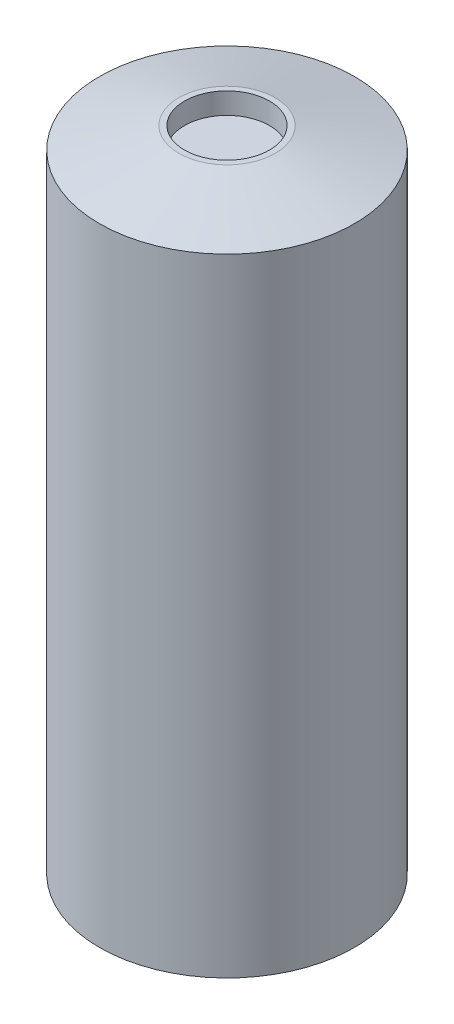
ISO-10303-21;
HEADER;
FILE_DESCRIPTION(('STEP AP214'),'2;1');
FILE_NAME('part.step','',(''),(''),'','','');
FILE_SCHEMA(('AUTOMOTIVE_DESIGN { 1 0 10303 214 1 1 1 1 }'));
ENDSEC;
DATA;
#1=APPLICATION_CONTEXT('core data for automotive mechanical design processes');
#2=APPLICATION_PROTOCOL_DEFINITION('international standard','automotive_design',2000,#1);
#3=PRODUCT_CONTEXT('',#1,'mechanical');
#4=PRODUCT('Part','Part','',(#3));
#5=PRODUCT_RELATED_PRODUCT_CATEGORY('part','',(#4));
#6=PRODUCT_DEFINITION_FORMATION('','',#4);
#7=PRODUCT_DEFINITION_CONTEXT('part definition',#1,'design');
#8=PRODUCT_DEFINITION('design','',#6,#7);
#9=PRODUCT_DEFINITION_SHAPE('','',#8);
#10=(LENGTH_UNIT() NAMED_UNIT(*) SI_UNIT(.MILLI.,.METRE.));
#11=(NAMED_UNIT(*) PLANE_ANGLE_UNIT() SI_UNIT($,.RADIAN.));
#12=(NAMED_UNIT(*) SI_UNIT($,.STERADIAN.) SOLID_ANGLE_UNIT());
#13=UNCERTAINTY_MEASURE_WITH_UNIT(LENGTH_MEASURE(1.E-05),#10,'distance_accuracy_value','');
#14=(GEOMETRIC_REPRESENTATION_CONTEXT(3) GLOBAL_UNCERTAINTY_ASSIGNED_CONTEXT((#13)) GLOBAL_UNIT_ASSIGNED_CONTEXT((#10,
#11,#12)) REPRESENTATION_CONTEXT('',''));
#15=CARTESIAN_POINT('',(0.,0.,0.));
#16=DIRECTION('',(0.,0.,1.));
#17=DIRECTION('',(1.,0.,0.));
#18=AXIS2_PLACEMENT_3D('',#15,#16,#17);
#19=CARTESIAN_POINT('',(0.,30.5,0.));
#20=DIRECTION('',(0.,-1.,0.));
#21=DIRECTION('',(0.,0.,-1.));
#22=AXIS2_PLACEMENT_3D('',#19,#20,#21);
#23=CYLINDRICAL_SURFACE('',#22,6.);
#24=CARTESIAN_POINT('',(0.,29.5,0.));
#25=DIRECTION('',(0.,1.,0.));
#26=DIRECTION('',(0.,0.,1.));
#27=AXIS2_PLACEMENT_3D('',#24,#25,#26);
#28=CIRCLE('',#27,6.);
#29=CARTESIAN_POINT('',(0.,29.5,6.));
#30=VERTEX_POINT('',#29);
#31=EDGE_CURVE('E10',#30,#30,#28,.F.);
#32=ORIENTED_EDGE('',*,*,#31,.T.);
#33=EDGE_LOOP('',(#32));
#34=FACE_BOUND('',#33,.T.);
#35=CARTESIAN_POINT('',(0.,0.,0.));
#36=DIRECTION('',(0.,1.,0.));
#37=DIRECTION('',(0.,0.,1.));
#38=AXIS2_PLACEMENT_3D('',#35,#36,#37);
#39=CIRCLE('',#38,6.);
#40=CARTESIAN_POINT('',(0.,0.,6.));
#41=VERTEX_POINT('',#40);
#42=EDGE_CURVE('E40',#41,#41,#39,.T.);
#43=ORIENTED_EDGE('',*,*,#42,.T.);
#44=EDGE_LOOP('',(#43));
#45=FACE_BOUND('',#44,.T.);
#46=ADVANCED_FACE('F29',(#34,#45),#23,.T.);
#47=CARTESIAN_POINT('',(0.,30.5,0.));
#48=DIRECTION('',(0.,1.,0.));
#49=DIRECTION('',(0.,0.,1.));
#50=AXIS2_PLACEMENT_3D('',#47,#48,#49);
#51=PLANE('',#50);
#52=CARTESIAN_POINT('',(0.,30.5,0.));
#53=DIRECTION('',(0.,1.,0.));
#54=DIRECTION('',(0.,0.,1.));
#55=AXIS2_PLACEMENT_3D('',#52,#53,#54);
#56=CIRCLE('',#55,2.);
#57=CARTESIAN_POINT('',(0.,30.5,2.));
#58=VERTEX_POINT('',#57);
#59=EDGE_CURVE('E47',#58,#58,#56,.T.);
#60=ORIENTED_EDGE('',*,*,#59,.F.);
#61=EDGE_LOOP('',(#60));
#62=FACE_BOUND('',#61,.T.);
#63=CARTESIAN_POINT('',(0.,30.5,0.));
#64=DIRECTION('',(0.,1.,0.));
#65=DIRECTION('',(0.,0.,1.));
#66=AXIS2_PLACEMENT_3D('',#63,#64,#65);
#67=CIRCLE('',#66,2.26794919243115);
#68=CARTESIAN_POINT('',(0.,30.5,2.26794919243115));
#69=VERTEX_POINT('',#68);
#70=EDGE_CURVE('E36',#69,#69,#67,.T.);
#71=ORIENTED_EDGE('',*,*,#70,.T.);
#72=EDGE_LOOP('',(#71));
#73=FACE_BOUND('',#72,.T.);
#74=ADVANCED_FACE('F61',(#62,#73),#51,.T.);
#75=CARTESIAN_POINT('',(0.,0.,0.));
#76=DIRECTION('',(0.,1.,0.));
#77=DIRECTION('',(0.,0.,1.));
#78=AXIS2_PLACEMENT_3D('',#75,#76,#77);
#79=PLANE('',#78);
#80=ORIENTED_EDGE('',*,*,#42,.F.);
#81=EDGE_LOOP('',(#80));
#82=FACE_BOUND('',#81,.T.);
#83=ADVANCED_FACE('F63',(#82),#79,.F.);
#84=CARTESIAN_POINT('',(0.,30.5,0.));
#85=DIRECTION('',(0.,-1.,0.));
#86=DIRECTION('',(0.,0.,-1.));
#87=AXIS2_PLACEMENT_3D('',#84,#85,#86);
#88=CONICAL_SURFACE('',#87,2.26794919243115,1.30899693899575);
#89=ORIENTED_EDGE('',*,*,#31,.F.);
#90=EDGE_LOOP('',(#89));
#91=FACE_BOUND('',#90,.T.);
#92=ORIENTED_EDGE('',*,*,#70,.F.);
#93=EDGE_LOOP('',(#92));
#94=FACE_BOUND('',#93,.T.);
#95=ADVANCED_FACE('F31',(#91,#94),#88,.T.);
#96=CARTESIAN_POINT('',(0.,29.5,0.));
#97=DIRECTION('',(0.,1.,0.));
#98=DIRECTION('',(0.,0.,1.));
#99=AXIS2_PLACEMENT_3D('',#96,#97,#98);
#100=CYLINDRICAL_SURFACE('',#99,2.);
#101=CARTESIAN_POINT('',(0.,29.5,0.));
#102=DIRECTION('',(0.,1.,0.));
#103=DIRECTION('',(0.,0.,1.));
#104=AXIS2_PLACEMENT_3D('',#101,#102,#103);
#105=CIRCLE('',#104,2.);
#106=CARTESIAN_POINT('',(0.,29.5,2.));
#107=VERTEX_POINT('',#106);
#108=EDGE_CURVE('E44',#107,#107,#105,.T.);
#109=ORIENTED_EDGE('',*,*,#108,.F.);
#110=EDGE_LOOP('',(#109));
#111=FACE_BOUND('',#110,.T.);
#112=ORIENTED_EDGE('',*,*,#59,.T.);
#113=EDGE_LOOP('',(#112));
#114=FACE_BOUND('',#113,.T.);
#115=ADVANCED_FACE('F55',(#111,#114),#100,.F.);
#116=CARTESIAN_POINT('',(0.,29.5,0.));
#117=DIRECTION('',(0.,1.,0.));
#118=DIRECTION('',(0.,0.,1.));
#119=AXIS2_PLACEMENT_3D('',#116,#117,#118);
#120=PLANE('',#119);
#121=ORIENTED_EDGE('',*,*,#108,.T.);
#122=EDGE_LOOP('',(#121));
#123=FACE_BOUND('',#122,.T.);
#124=ADVANCED_FACE('F53',(#123),#120,.T.);
#125=CLOSED_SHELL('',(#46,#74,#83,#95,#115,#124));
#126=MANIFOLD_SOLID_BREP('B2',#125);
#127=ADVANCED_BREP_SHAPE_REPRESENTATION('',(#18,#126),#14);
#128=SHAPE_DEFINITION_REPRESENTATION(#9,#127);
ENDSEC;
END-ISO-10303-21;
